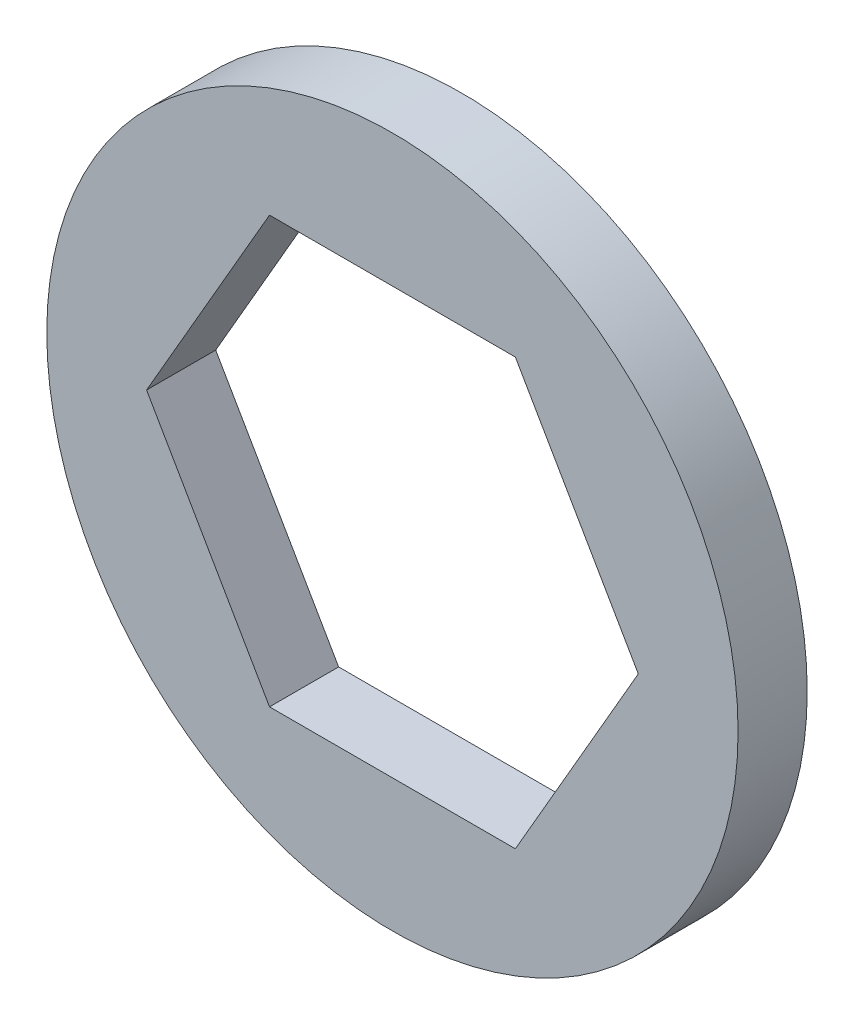
ISO-10303-21;
HEADER;
FILE_DESCRIPTION(('STEP AP214'),'2;1');
FILE_NAME('part.step','',(''),(''),'','','');
FILE_SCHEMA(('AUTOMOTIVE_DESIGN { 1 0 10303 214 1 1 1 1 }'));
ENDSEC;
DATA;
#1=APPLICATION_CONTEXT('core data for automotive mechanical design processes');
#2=APPLICATION_PROTOCOL_DEFINITION('international standard','automotive_design',2000,#1);
#3=PRODUCT_CONTEXT('',#1,'mechanical');
#4=PRODUCT('Part','Part','',(#3));
#5=PRODUCT_RELATED_PRODUCT_CATEGORY('part','',(#4));
#6=PRODUCT_DEFINITION_FORMATION('','',#4);
#7=PRODUCT_DEFINITION_CONTEXT('part definition',#1,'design');
#8=PRODUCT_DEFINITION('design','',#6,#7);
#9=PRODUCT_DEFINITION_SHAPE('','',#8);
#10=(LENGTH_UNIT() NAMED_UNIT(*) SI_UNIT(.MILLI.,.METRE.));
#11=(NAMED_UNIT(*) PLANE_ANGLE_UNIT() SI_UNIT($,.RADIAN.));
#12=(NAMED_UNIT(*) SI_UNIT($,.STERADIAN.) SOLID_ANGLE_UNIT());
#13=UNCERTAINTY_MEASURE_WITH_UNIT(LENGTH_MEASURE(1.E-05),#10,'distance_accuracy_value','');
#14=(GEOMETRIC_REPRESENTATION_CONTEXT(3) GLOBAL_UNCERTAINTY_ASSIGNED_CONTEXT((#13)) GLOBAL_UNIT_ASSIGNED_CONTEXT((#10,
#11,#12)) REPRESENTATION_CONTEXT('',''));
#15=CARTESIAN_POINT('',(0.,0.,0.));
#16=DIRECTION('',(0.,0.,1.));
#17=DIRECTION('',(1.,0.,0.));
#18=AXIS2_PLACEMENT_3D('',#15,#16,#17);
#19=CARTESIAN_POINT('',(0.,0.,-0.79375));
#20=DIRECTION('',(0.,0.,1.));
#21=DIRECTION('',(1.,0.,0.));
#22=AXIS2_PLACEMENT_3D('',#19,#20,#21);
#23=PLANE('',#22);
#24=DIRECTION('',(-0.5,-0.866025403784439,0.));
#25=VECTOR('',#24,1.);
#26=CARTESIAN_POINT('',(2.82295414120268,-4.8895,-0.79375));
#27=LINE('',#26,#25);
#28=CARTESIAN_POINT('',(5.64590828240535,0.,-0.79375));
#29=VERTEX_POINT('',#28);
#30=CARTESIAN_POINT('',(2.82295414120268,-4.8895,-0.79375));
#31=VERTEX_POINT('',#30);
#32=EDGE_CURVE('E70',#29,#31,#27,.T.);
#33=ORIENTED_EDGE('',*,*,#32,.F.);
#34=DIRECTION('',(0.500000000000001,-0.866025403784438,0.));
#35=VECTOR('',#34,1.);
#36=CARTESIAN_POINT('',(5.64590828240535,0.,-0.79375));
#37=LINE('',#36,#35);
#38=CARTESIAN_POINT('',(2.82295414120267,4.8895,-0.79375));
#39=VERTEX_POINT('',#38);
#40=EDGE_CURVE('E100',#39,#29,#37,.T.);
#41=ORIENTED_EDGE('',*,*,#40,.F.);
#42=DIRECTION('',(1.,0.,0.));
#43=VECTOR('',#42,1.);
#44=CARTESIAN_POINT('',(2.82295414120267,4.8895,-0.79375));
#45=LINE('',#44,#43);
#46=CARTESIAN_POINT('',(-2.82295414120268,4.8895,-0.79375));
#47=VERTEX_POINT('',#46);
#48=EDGE_CURVE('E108',#47,#39,#45,.T.);
#49=ORIENTED_EDGE('',*,*,#48,.F.);
#50=DIRECTION('',(0.5,0.866025403784439,0.));
#51=VECTOR('',#50,1.);
#52=CARTESIAN_POINT('',(-2.82295414120268,4.8895,-0.79375));
#53=LINE('',#52,#51);
#54=CARTESIAN_POINT('',(-5.64590828240535,0.,-0.79375));
#55=VERTEX_POINT('',#54);
#56=EDGE_CURVE('E113',#55,#47,#53,.T.);
#57=ORIENTED_EDGE('',*,*,#56,.F.);
#58=DIRECTION('',(-0.5,0.866025403784439,0.));
#59=VECTOR('',#58,1.);
#60=CARTESIAN_POINT('',(-5.64590828240535,0.,-0.79375));
#61=LINE('',#60,#59);
#62=CARTESIAN_POINT('',(-2.82295414120268,-4.8895,-0.79375));
#63=VERTEX_POINT('',#62);
#64=EDGE_CURVE('E65',#63,#55,#61,.T.);
#65=ORIENTED_EDGE('',*,*,#64,.F.);
#66=DIRECTION('',(-1.,0.,0.));
#67=VECTOR('',#66,1.);
#68=CARTESIAN_POINT('',(-2.82295414120268,-4.8895,-0.79375));
#69=LINE('',#68,#67);
#70=EDGE_CURVE('E67',#31,#63,#69,.T.);
#71=ORIENTED_EDGE('',*,*,#70,.F.);
#72=EDGE_LOOP('',(#33,#41,#49,#57,#65,#71));
#73=FACE_BOUND('',#72,.T.);
#74=CARTESIAN_POINT('',(0.,0.,-0.79375));
#75=DIRECTION('',(0.,0.,-1.));
#76=DIRECTION('',(-1.,0.,0.));
#77=AXIS2_PLACEMENT_3D('',#74,#75,#76);
#78=CIRCLE('',#77,7.9375);
#79=CARTESIAN_POINT('',(-7.9375,0.,-0.79375));
#80=VERTEX_POINT('',#79);
#81=EDGE_CURVE('E17',#80,#80,#78,.F.);
#82=ORIENTED_EDGE('',*,*,#81,.F.);
#83=EDGE_LOOP('',(#82));
#84=FACE_BOUND('',#83,.T.);
#85=ADVANCED_FACE('F14',(#73,#84),#23,.F.);
#86=CARTESIAN_POINT('',(0.,0.,0.79375));
#87=DIRECTION('',(0.,0.,-1.));
#88=DIRECTION('',(-1.,0.,0.));
#89=AXIS2_PLACEMENT_3D('',#86,#87,#88);
#90=CYLINDRICAL_SURFACE('',#89,7.9375);
#91=ORIENTED_EDGE('',*,*,#81,.T.);
#92=EDGE_LOOP('',(#91));
#93=FACE_BOUND('',#92,.T.);
#94=CARTESIAN_POINT('',(0.,0.,0.79375));
#95=DIRECTION('',(0.,0.,-1.));
#96=DIRECTION('',(-1.,0.,0.));
#97=AXIS2_PLACEMENT_3D('',#94,#95,#96);
#98=CIRCLE('',#97,7.9375);
#99=CARTESIAN_POINT('',(-7.9375,0.,0.79375));
#100=VERTEX_POINT('',#99);
#101=EDGE_CURVE('E92',#100,#100,#98,.F.);
#102=ORIENTED_EDGE('',*,*,#101,.F.);
#103=EDGE_LOOP('',(#102));
#104=FACE_BOUND('',#103,.T.);
#105=ADVANCED_FACE('F149',(#93,#104),#90,.T.);
#106=CARTESIAN_POINT('',(2.82295414120268,-4.8895,0.79375));
#107=DIRECTION('',(-0.866025403784439,0.5,0.));
#108=DIRECTION('',(-0.5,-0.866025403784439,0.));
#109=AXIS2_PLACEMENT_3D('',#106,#107,#108);
#110=PLANE('',#109);
#111=DIRECTION('',(-0.5,-0.866025403784439,0.));
#112=VECTOR('',#111,1.);
#113=CARTESIAN_POINT('',(5.64590828240535,0.,0.79375));
#114=LINE('',#113,#112);
#115=CARTESIAN_POINT('',(5.64590828240535,0.,0.79375));
#116=VERTEX_POINT('',#115);
#117=CARTESIAN_POINT('',(2.82295414120268,-4.8895,0.79375));
#118=VERTEX_POINT('',#117);
#119=EDGE_CURVE('E94',#116,#118,#114,.T.);
#120=ORIENTED_EDGE('',*,*,#119,.F.);
#121=DIRECTION('',(0.,0.,1.));
#122=VECTOR('',#121,1.);
#123=CARTESIAN_POINT('',(5.64590828240535,0.,0.79375));
#124=LINE('',#123,#122);
#125=EDGE_CURVE('E81',#29,#116,#124,.T.);
#126=ORIENTED_EDGE('',*,*,#125,.F.);
#127=ORIENTED_EDGE('',*,*,#32,.T.);
#128=DIRECTION('',(0.,0.,1.));
#129=VECTOR('',#128,1.);
#130=CARTESIAN_POINT('',(2.82295414120268,-4.8895,0.79375));
#131=LINE('',#130,#129);
#132=EDGE_CURVE('E75',#118,#31,#131,.F.);
#133=ORIENTED_EDGE('',*,*,#132,.F.);
#134=EDGE_LOOP('',(#120,#126,#127,#133));
#135=FACE_BOUND('',#134,.T.);
#136=ADVANCED_FACE('F78',(#135),#110,.T.);
#137=CARTESIAN_POINT('',(-2.82295414120268,-4.8895,0.79375));
#138=DIRECTION('',(0.,1.,0.));
#139=DIRECTION('',(-1.,0.,0.));
#140=AXIS2_PLACEMENT_3D('',#137,#138,#139);
#141=PLANE('',#140);
#142=DIRECTION('',(1.,0.,0.));
#143=VECTOR('',#142,1.);
#144=CARTESIAN_POINT('',(0.,-4.8895,0.79375));
#145=LINE('',#144,#143);
#146=CARTESIAN_POINT('',(-2.82295414120268,-4.8895,0.79375));
#147=VERTEX_POINT('',#146);
#148=EDGE_CURVE('E86',#118,#147,#145,.F.);
#149=ORIENTED_EDGE('',*,*,#148,.F.);
#150=ORIENTED_EDGE('',*,*,#132,.T.);
#151=ORIENTED_EDGE('',*,*,#70,.T.);
#152=DIRECTION('',(0.,0.,1.));
#153=VECTOR('',#152,1.);
#154=CARTESIAN_POINT('',(-2.82295414120268,-4.8895,0.79375));
#155=LINE('',#154,#153);
#156=EDGE_CURVE('E89',#147,#63,#155,.F.);
#157=ORIENTED_EDGE('',*,*,#156,.F.);
#158=EDGE_LOOP('',(#149,#150,#151,#157));
#159=FACE_BOUND('',#158,.T.);
#160=ADVANCED_FACE('F84',(#159),#141,.T.);
#161=CARTESIAN_POINT('',(-5.64590828240535,0.,0.79375));
#162=DIRECTION('',(0.866025403784439,0.5,0.));
#163=DIRECTION('',(-0.5,0.866025403784439,0.));
#164=AXIS2_PLACEMENT_3D('',#161,#162,#163);
#165=PLANE('',#164);
#166=DIRECTION('',(-0.5,0.866025403784439,0.));
#167=VECTOR('',#166,1.);
#168=CARTESIAN_POINT('',(-2.82295414120268,-4.8895,0.79375));
#169=LINE('',#168,#167);
#170=CARTESIAN_POINT('',(-5.64590828240535,0.,0.79375));
#171=VERTEX_POINT('',#170);
#172=EDGE_CURVE('E119',#147,#171,#169,.T.);
#173=ORIENTED_EDGE('',*,*,#172,.F.);
#174=ORIENTED_EDGE('',*,*,#156,.T.);
#175=ORIENTED_EDGE('',*,*,#64,.T.);
#176=DIRECTION('',(0.,0.,1.));
#177=VECTOR('',#176,1.);
#178=CARTESIAN_POINT('',(-5.64590828240535,0.,0.79375));
#179=LINE('',#178,#177);
#180=EDGE_CURVE('E110',#171,#55,#179,.F.);
#181=ORIENTED_EDGE('',*,*,#180,.F.);
#182=EDGE_LOOP('',(#173,#174,#175,#181));
#183=FACE_BOUND('',#182,.T.);
#184=ADVANCED_FACE('F117',(#183),#165,.T.);
#185=CARTESIAN_POINT('',(-2.82295414120268,4.8895,0.79375));
#186=DIRECTION('',(0.866025403784439,-0.5,0.));
#187=DIRECTION('',(0.5,0.866025403784439,0.));
#188=AXIS2_PLACEMENT_3D('',#185,#186,#187);
#189=PLANE('',#188);
#190=DIRECTION('',(0.5,0.866025403784439,0.));
#191=VECTOR('',#190,1.);
#192=CARTESIAN_POINT('',(-5.64590828240535,0.,0.79375));
#193=LINE('',#192,#191);
#194=CARTESIAN_POINT('',(-2.82295414120268,4.8895,0.79375));
#195=VERTEX_POINT('',#194);
#196=EDGE_CURVE('E123',#171,#195,#193,.T.);
#197=ORIENTED_EDGE('',*,*,#196,.F.);
#198=ORIENTED_EDGE('',*,*,#180,.T.);
#199=ORIENTED_EDGE('',*,*,#56,.T.);
#200=DIRECTION('',(0.,0.,1.));
#201=VECTOR('',#200,1.);
#202=CARTESIAN_POINT('',(-2.82295414120268,4.8895,0.79375));
#203=LINE('',#202,#201);
#204=EDGE_CURVE('E105',#195,#47,#203,.F.);
#205=ORIENTED_EDGE('',*,*,#204,.F.);
#206=EDGE_LOOP('',(#197,#198,#199,#205));
#207=FACE_BOUND('',#206,.T.);
#208=ADVANCED_FACE('F131',(#207),#189,.T.);
#209=CARTESIAN_POINT('',(2.82295414120267,4.8895,0.79375));
#210=DIRECTION('',(0.,-1.,0.));
#211=DIRECTION('',(1.,0.,0.));
#212=AXIS2_PLACEMENT_3D('',#209,#210,#211);
#213=PLANE('',#212);
#214=DIRECTION('',(1.,0.,0.));
#215=VECTOR('',#214,1.);
#216=CARTESIAN_POINT('',(0.,4.8895,0.79375));
#217=LINE('',#216,#215);
#218=CARTESIAN_POINT('',(2.82295414120267,4.8895,0.79375));
#219=VERTEX_POINT('',#218);
#220=EDGE_CURVE('E23',#195,#219,#217,.T.);
#221=ORIENTED_EDGE('',*,*,#220,.F.);
#222=ORIENTED_EDGE('',*,*,#204,.T.);
#223=ORIENTED_EDGE('',*,*,#48,.T.);
#224=DIRECTION('',(0.,0.,1.));
#225=VECTOR('',#224,1.);
#226=CARTESIAN_POINT('',(2.82295414120267,4.8895,0.79375));
#227=LINE('',#226,#225);
#228=EDGE_CURVE('E32',#219,#39,#227,.F.);
#229=ORIENTED_EDGE('',*,*,#228,.F.);
#230=EDGE_LOOP('',(#221,#222,#223,#229));
#231=FACE_BOUND('',#230,.T.);
#232=ADVANCED_FACE('F129',(#231),#213,.T.);
#233=CARTESIAN_POINT('',(5.64590828240535,0.,0.79375));
#234=DIRECTION('',(-0.866025403784438,-0.500000000000001,0.));
#235=DIRECTION('',(0.500000000000001,-0.866025403784438,0.));
#236=AXIS2_PLACEMENT_3D('',#233,#234,#235);
#237=PLANE('',#236);
#238=DIRECTION('',(0.5,-0.866025403784438,0.));
#239=VECTOR('',#238,1.);
#240=CARTESIAN_POINT('',(2.82295414120267,4.8895,0.79375));
#241=LINE('',#240,#239);
#242=EDGE_CURVE('E9',#219,#116,#241,.T.);
#243=ORIENTED_EDGE('',*,*,#242,.F.);
#244=ORIENTED_EDGE('',*,*,#228,.T.);
#245=ORIENTED_EDGE('',*,*,#40,.T.);
#246=ORIENTED_EDGE('',*,*,#125,.T.);
#247=EDGE_LOOP('',(#243,#244,#245,#246));
#248=FACE_BOUND('',#247,.T.);
#249=ADVANCED_FACE('F132',(#248),#237,.T.);
#250=CARTESIAN_POINT('',(0.,0.,0.79375));
#251=DIRECTION('',(0.,0.,1.));
#252=DIRECTION('',(1.,0.,0.));
#253=AXIS2_PLACEMENT_3D('',#250,#251,#252);
#254=PLANE('',#253);
#255=ORIENTED_EDGE('',*,*,#220,.T.);
#256=ORIENTED_EDGE('',*,*,#242,.T.);
#257=ORIENTED_EDGE('',*,*,#119,.T.);
#258=ORIENTED_EDGE('',*,*,#148,.T.);
#259=ORIENTED_EDGE('',*,*,#172,.T.);
#260=ORIENTED_EDGE('',*,*,#196,.T.);
#261=EDGE_LOOP('',(#255,#256,#257,#258,#259,#260));
#262=FACE_BOUND('',#261,.T.);
#263=ORIENTED_EDGE('',*,*,#101,.T.);
#264=EDGE_LOOP('',(#263));
#265=FACE_BOUND('',#264,.T.);
#266=ADVANCED_FACE('F126',(#262,#265),#254,.T.);
#267=CLOSED_SHELL('',(#85,#105,#136,#160,#184,#208,#232,#249,#266));
#268=MANIFOLD_SOLID_BREP('B1',#267);
#269=ADVANCED_BREP_SHAPE_REPRESENTATION('',(#18,#268),#14);
#270=SHAPE_DEFINITION_REPRESENTATION(#9,#269);
ENDSEC;
END-ISO-10303-21;
